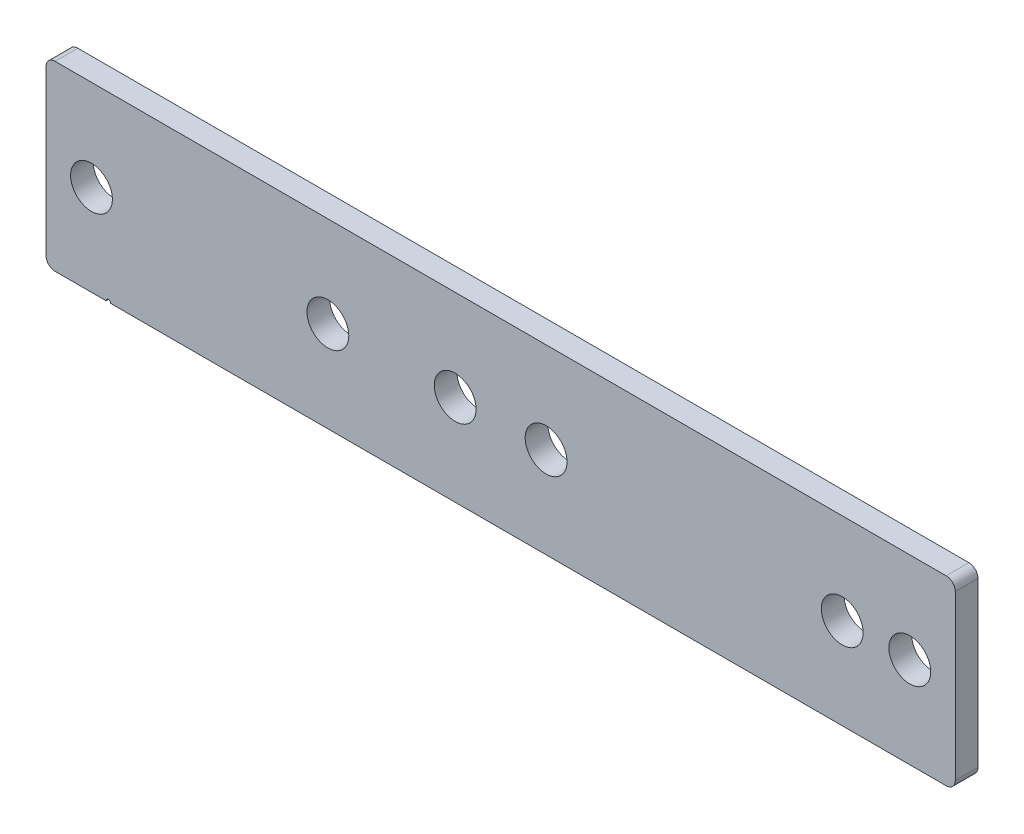
ISO-10303-21;
HEADER;
FILE_DESCRIPTION(('STEP AP214'),'2;1');
FILE_NAME('part.step','',(''),(''),'','','');
FILE_SCHEMA(('AUTOMOTIVE_DESIGN { 1 0 10303 214 1 1 1 1 }'));
ENDSEC;
DATA;
#1=APPLICATION_CONTEXT('core data for automotive mechanical design processes');
#2=APPLICATION_PROTOCOL_DEFINITION('international standard','automotive_design',2000,#1);
#3=PRODUCT_CONTEXT('',#1,'mechanical');
#4=PRODUCT('Part','Part','',(#3));
#5=PRODUCT_RELATED_PRODUCT_CATEGORY('part','',(#4));
#6=PRODUCT_DEFINITION_FORMATION('','',#4);
#7=PRODUCT_DEFINITION_CONTEXT('part definition',#1,'design');
#8=PRODUCT_DEFINITION('design','',#6,#7);
#9=PRODUCT_DEFINITION_SHAPE('','',#8);
#10=(LENGTH_UNIT() NAMED_UNIT(*) SI_UNIT(.MILLI.,.METRE.));
#11=(NAMED_UNIT(*) PLANE_ANGLE_UNIT() SI_UNIT($,.RADIAN.));
#12=(NAMED_UNIT(*) SI_UNIT($,.STERADIAN.) SOLID_ANGLE_UNIT());
#13=UNCERTAINTY_MEASURE_WITH_UNIT(LENGTH_MEASURE(1.E-05),#10,'distance_accuracy_value','');
#14=(GEOMETRIC_REPRESENTATION_CONTEXT(3) GLOBAL_UNCERTAINTY_ASSIGNED_CONTEXT((#13)) GLOBAL_UNIT_ASSIGNED_CONTEXT((#10,
#11,#12)) REPRESENTATION_CONTEXT('',''));
#15=CARTESIAN_POINT('',(0.,0.,0.));
#16=DIRECTION('',(0.,0.,1.));
#17=DIRECTION('',(1.,0.,0.));
#18=AXIS2_PLACEMENT_3D('',#15,#16,#17);
#19=CARTESIAN_POINT('',(-100.,-20.,5.));
#20=DIRECTION('',(0.,1.,0.));
#21=DIRECTION('',(-1.,0.,0.));
#22=AXIS2_PLACEMENT_3D('',#19,#20,#21);
#23=PLANE('',#22);
#24=DIRECTION('',(1.,0.,0.));
#25=VECTOR('',#24,1.);
#26=CARTESIAN_POINT('',(-100.,-20.,5.));
#27=LINE('',#26,#25);
#28=CARTESIAN_POINT('',(-98.,-20.,5.));
#29=VERTEX_POINT('',#28);
#30=CARTESIAN_POINT('',(-86.7842712474616,-20.,5.));
#31=VERTEX_POINT('',#30);
#32=EDGE_CURVE('E95',#29,#31,#27,.T.);
#33=ORIENTED_EDGE('',*,*,#32,.F.);
#34=DIRECTION('',(0.,0.,-1.));
#35=VECTOR('',#34,1.);
#36=CARTESIAN_POINT('',(-98.,-20.,5.));
#37=LINE('',#36,#35);
#38=CARTESIAN_POINT('',(-98.,-20.,0.));
#39=VERTEX_POINT('',#38);
#40=EDGE_CURVE('E10',#29,#39,#37,.T.);
#41=ORIENTED_EDGE('',*,*,#40,.T.);
#42=DIRECTION('',(1.,0.,0.));
#43=VECTOR('',#42,1.);
#44=CARTESIAN_POINT('',(-100.,-20.,0.));
#45=LINE('',#44,#43);
#46=CARTESIAN_POINT('',(-86.7842712474616,-20.,0.));
#47=VERTEX_POINT('',#46);
#48=EDGE_CURVE('E119',#39,#47,#45,.T.);
#49=ORIENTED_EDGE('',*,*,#48,.T.);
#50=DIRECTION('',(0.,0.,1.));
#51=VECTOR('',#50,1.);
#52=CARTESIAN_POINT('',(-86.7842712474616,-20.,-13.0107647738325));
#53=LINE('',#52,#51);
#54=EDGE_CURVE('E112',#47,#31,#53,.T.);
#55=ORIENTED_EDGE('',*,*,#54,.T.);
#56=EDGE_LOOP('',(#33,#41,#49,#55));
#57=FACE_BOUND('',#56,.T.);
#58=ADVANCED_FACE('F16',(#57),#23,.F.);
#59=CARTESIAN_POINT('',(-100.,20.,5.));
#60=DIRECTION('',(1.,0.,0.));
#61=DIRECTION('',(0.,1.,0.));
#62=AXIS2_PLACEMENT_3D('',#59,#60,#61);
#63=PLANE('',#62);
#64=DIRECTION('',(0.,-1.,0.));
#65=VECTOR('',#64,1.);
#66=CARTESIAN_POINT('',(-100.,20.,5.));
#67=LINE('',#66,#65);
#68=CARTESIAN_POINT('',(-100.,18.,5.));
#69=VERTEX_POINT('',#68);
#70=CARTESIAN_POINT('',(-100.,-18.,5.));
#71=VERTEX_POINT('',#70);
#72=EDGE_CURVE('E132',#69,#71,#67,.T.);
#73=ORIENTED_EDGE('',*,*,#72,.F.);
#74=DIRECTION('',(0.,0.,-1.));
#75=VECTOR('',#74,1.);
#76=CARTESIAN_POINT('',(-100.,18.,5.));
#77=LINE('',#76,#75);
#78=CARTESIAN_POINT('',(-100.,18.,0.));
#79=VERTEX_POINT('',#78);
#80=EDGE_CURVE('E25',#69,#79,#77,.T.);
#81=ORIENTED_EDGE('',*,*,#80,.T.);
#82=DIRECTION('',(0.,-1.,0.));
#83=VECTOR('',#82,1.);
#84=CARTESIAN_POINT('',(-100.,20.,0.));
#85=LINE('',#84,#83);
#86=CARTESIAN_POINT('',(-100.,-18.,0.));
#87=VERTEX_POINT('',#86);
#88=EDGE_CURVE('E131',#79,#87,#85,.T.);
#89=ORIENTED_EDGE('',*,*,#88,.T.);
#90=DIRECTION('',(0.,0.,-1.));
#91=VECTOR('',#90,1.);
#92=CARTESIAN_POINT('',(-100.,-18.,5.));
#93=LINE('',#92,#91);
#94=EDGE_CURVE('E41',#87,#71,#93,.F.);
#95=ORIENTED_EDGE('',*,*,#94,.T.);
#96=EDGE_LOOP('',(#73,#81,#89,#95));
#97=FACE_BOUND('',#96,.T.);
#98=ADVANCED_FACE('F233',(#97),#63,.F.);
#99=CARTESIAN_POINT('',(-85.7842712474616,-20.,0.));
#100=VERTEX_POINT('',#99);
#101=CARTESIAN_POINT('',(98.,-19.9999999999999,0.));
#102=VERTEX_POINT('',#101);
#103=EDGE_CURVE('E141',#100,#102,#45,.T.);
#104=ORIENTED_EDGE('',*,*,#103,.T.);
#105=DIRECTION('',(0.,0.,-1.));
#106=VECTOR('',#105,1.);
#107=CARTESIAN_POINT('',(98.,-19.9999999999999,5.));
#108=LINE('',#107,#106);
#109=CARTESIAN_POINT('',(98.,-19.9999999999999,5.));
#110=VERTEX_POINT('',#109);
#111=EDGE_CURVE('E172',#102,#110,#108,.F.);
#112=ORIENTED_EDGE('',*,*,#111,.T.);
#113=CARTESIAN_POINT('',(-85.7842712474616,-20.,5.));
#114=VERTEX_POINT('',#113);
#115=EDGE_CURVE('E107',#114,#110,#27,.T.);
#116=ORIENTED_EDGE('',*,*,#115,.F.);
#117=DIRECTION('',(0.,0.,1.));
#118=VECTOR('',#117,1.);
#119=CARTESIAN_POINT('',(-85.7842712474616,-20.,-13.0107647738325));
#120=LINE('',#119,#118);
#121=EDGE_CURVE('E115',#100,#114,#120,.T.);
#122=ORIENTED_EDGE('',*,*,#121,.F.);
#123=EDGE_LOOP('',(#104,#112,#116,#122));
#124=FACE_BOUND('',#123,.T.);
#125=ADVANCED_FACE('F207',(#124),#23,.F.);
#126=CARTESIAN_POINT('',(100.,20.,5.));
#127=DIRECTION('',(-1.,0.,0.));
#128=DIRECTION('',(0.,0.,1.));
#129=AXIS2_PLACEMENT_3D('',#126,#127,#128);
#130=PLANE('',#129);
#131=DIRECTION('',(0.,1.,0.));
#132=VECTOR('',#131,1.);
#133=CARTESIAN_POINT('',(100.,20.,0.));
#134=LINE('',#133,#132);
#135=CARTESIAN_POINT('',(100.,-18.,0.));
#136=VERTEX_POINT('',#135);
#137=CARTESIAN_POINT('',(100.,18.,0.));
#138=VERTEX_POINT('',#137);
#139=EDGE_CURVE('E143',#136,#138,#134,.T.);
#140=ORIENTED_EDGE('',*,*,#139,.T.);
#141=DIRECTION('',(0.,0.,-1.));
#142=VECTOR('',#141,1.);
#143=CARTESIAN_POINT('',(100.,18.,5.));
#144=LINE('',#143,#142);
#145=CARTESIAN_POINT('',(100.,18.,5.));
#146=VERTEX_POINT('',#145);
#147=EDGE_CURVE('E163',#138,#146,#144,.F.);
#148=ORIENTED_EDGE('',*,*,#147,.T.);
#149=DIRECTION('',(0.,1.,0.));
#150=VECTOR('',#149,1.);
#151=CARTESIAN_POINT('',(100.,20.,5.));
#152=LINE('',#151,#150);
#153=CARTESIAN_POINT('',(100.,-18.,5.));
#154=VERTEX_POINT('',#153);
#155=EDGE_CURVE('E106',#154,#146,#152,.T.);
#156=ORIENTED_EDGE('',*,*,#155,.F.);
#157=DIRECTION('',(0.,0.,-1.));
#158=VECTOR('',#157,1.);
#159=CARTESIAN_POINT('',(100.,-18.,5.));
#160=LINE('',#159,#158);
#161=EDGE_CURVE('E160',#154,#136,#160,.T.);
#162=ORIENTED_EDGE('',*,*,#161,.T.);
#163=EDGE_LOOP('',(#140,#148,#156,#162));
#164=FACE_BOUND('',#163,.T.);
#165=ADVANCED_FACE('F218',(#164),#130,.F.);
#166=CARTESIAN_POINT('',(-100.,20.,5.));
#167=DIRECTION('',(0.,-1.,0.));
#168=DIRECTION('',(1.,0.,0.));
#169=AXIS2_PLACEMENT_3D('',#166,#167,#168);
#170=PLANE('',#169);
#171=DIRECTION('',(-1.,0.,0.));
#172=VECTOR('',#171,1.);
#173=CARTESIAN_POINT('',(-100.,20.,5.));
#174=LINE('',#173,#172);
#175=CARTESIAN_POINT('',(98.,20.,5.));
#176=VERTEX_POINT('',#175);
#177=CARTESIAN_POINT('',(-98.,20.,5.));
#178=VERTEX_POINT('',#177);
#179=EDGE_CURVE('E136',#176,#178,#174,.T.);
#180=ORIENTED_EDGE('',*,*,#179,.F.);
#181=DIRECTION('',(0.,0.,-1.));
#182=VECTOR('',#181,1.);
#183=CARTESIAN_POINT('',(98.,20.,5.));
#184=LINE('',#183,#182);
#185=CARTESIAN_POINT('',(98.,20.,0.));
#186=VERTEX_POINT('',#185);
#187=EDGE_CURVE('E149',#176,#186,#184,.T.);
#188=ORIENTED_EDGE('',*,*,#187,.T.);
#189=DIRECTION('',(-1.,0.,0.));
#190=VECTOR('',#189,1.);
#191=CARTESIAN_POINT('',(-100.,20.,0.));
#192=LINE('',#191,#190);
#193=CARTESIAN_POINT('',(-98.,20.,0.));
#194=VERTEX_POINT('',#193);
#195=EDGE_CURVE('E133',#186,#194,#192,.T.);
#196=ORIENTED_EDGE('',*,*,#195,.T.);
#197=DIRECTION('',(0.,0.,-1.));
#198=VECTOR('',#197,1.);
#199=CARTESIAN_POINT('',(-98.,20.,5.));
#200=LINE('',#199,#198);
#201=EDGE_CURVE('E139',#194,#178,#200,.F.);
#202=ORIENTED_EDGE('',*,*,#201,.T.);
#203=EDGE_LOOP('',(#180,#188,#196,#202));
#204=FACE_BOUND('',#203,.T.);
#205=ADVANCED_FACE('F226',(#204),#170,.F.);
#206=CARTESIAN_POINT('',(0.,0.,5.));
#207=DIRECTION('',(0.,0.,1.));
#208=DIRECTION('',(1.,0.,0.));
#209=AXIS2_PLACEMENT_3D('',#206,#207,#208);
#210=PLANE('',#209);
#211=CARTESIAN_POINT('',(-9.99999999999999,0.,5.));
#212=DIRECTION('',(0.,0.,1.));
#213=DIRECTION('',(1.,0.,0.));
#214=AXIS2_PLACEMENT_3D('',#211,#212,#213);
#215=CIRCLE('',#214,4.6);
#216=CARTESIAN_POINT('',(-5.4,0.,5.));
#217=VERTEX_POINT('',#216);
#218=EDGE_CURVE('E183',#217,#217,#215,.T.);
#219=ORIENTED_EDGE('',*,*,#218,.F.);
#220=EDGE_LOOP('',(#219));
#221=FACE_BOUND('',#220,.T.);
#222=CARTESIAN_POINT('',(10.,0.,5.));
#223=DIRECTION('',(0.,0.,1.));
#224=DIRECTION('',(1.,0.,0.));
#225=AXIS2_PLACEMENT_3D('',#222,#223,#224);
#226=CIRCLE('',#225,4.6);
#227=CARTESIAN_POINT('',(14.6,0.,5.));
#228=VERTEX_POINT('',#227);
#229=EDGE_CURVE('E290',#228,#228,#226,.T.);
#230=ORIENTED_EDGE('',*,*,#229,.F.);
#231=EDGE_LOOP('',(#230));
#232=FACE_BOUND('',#231,.T.);
#233=CARTESIAN_POINT('',(90.,0.,5.));
#234=DIRECTION('',(0.,0.,1.));
#235=DIRECTION('',(1.,0.,0.));
#236=AXIS2_PLACEMENT_3D('',#233,#234,#235);
#237=CIRCLE('',#236,4.60000000000001);
#238=CARTESIAN_POINT('',(94.6,0.,5.));
#239=VERTEX_POINT('',#238);
#240=EDGE_CURVE('E196',#239,#239,#237,.T.);
#241=ORIENTED_EDGE('',*,*,#240,.F.);
#242=EDGE_LOOP('',(#241));
#243=FACE_BOUND('',#242,.T.);
#244=CARTESIAN_POINT('',(-90.,0.,5.));
#245=DIRECTION('',(0.,0.,1.));
#246=DIRECTION('',(1.,0.,0.));
#247=AXIS2_PLACEMENT_3D('',#244,#245,#246);
#248=CIRCLE('',#247,4.6);
#249=CARTESIAN_POINT('',(-85.4,0.,5.));
#250=VERTEX_POINT('',#249);
#251=EDGE_CURVE('E179',#250,#250,#248,.T.);
#252=ORIENTED_EDGE('',*,*,#251,.F.);
#253=EDGE_LOOP('',(#252));
#254=FACE_BOUND('',#253,.T.);
#255=CARTESIAN_POINT('',(75.1370849898473,0.,5.));
#256=DIRECTION('',(0.,0.,1.));
#257=DIRECTION('',(1.,0.,0.));
#258=AXIS2_PLACEMENT_3D('',#255,#256,#257);
#259=CIRCLE('',#258,4.60000000000001);
#260=CARTESIAN_POINT('',(79.7370849898473,0.,5.));
#261=VERTEX_POINT('',#260);
#262=EDGE_CURVE('E198',#261,#261,#259,.T.);
#263=ORIENTED_EDGE('',*,*,#262,.F.);
#264=EDGE_LOOP('',(#263));
#265=FACE_BOUND('',#264,.T.);
#266=ORIENTED_EDGE('',*,*,#155,.T.);
#267=CARTESIAN_POINT('',(98.,18.,5.));
#268=DIRECTION('',(0.,0.,1.));
#269=DIRECTION('',(1.,0.,0.));
#270=AXIS2_PLACEMENT_3D('',#267,#268,#269);
#271=CIRCLE('',#270,2.);
#272=EDGE_CURVE('E170',#146,#176,#271,.T.);
#273=ORIENTED_EDGE('',*,*,#272,.T.);
#274=ORIENTED_EDGE('',*,*,#179,.T.);
#275=CARTESIAN_POINT('',(-98.,18.,5.));
#276=DIRECTION('',(0.,0.,1.));
#277=DIRECTION('',(1.,0.,0.));
#278=AXIS2_PLACEMENT_3D('',#275,#276,#277);
#279=CIRCLE('',#278,2.);
#280=EDGE_CURVE('E166',#178,#69,#279,.T.);
#281=ORIENTED_EDGE('',*,*,#280,.T.);
#282=ORIENTED_EDGE('',*,*,#72,.T.);
#283=CARTESIAN_POINT('',(-98.,-18.,5.));
#284=DIRECTION('',(0.,0.,1.));
#285=DIRECTION('',(1.,0.,0.));
#286=AXIS2_PLACEMENT_3D('',#283,#284,#285);
#287=CIRCLE('',#286,2.);
#288=EDGE_CURVE('E33',#71,#29,#287,.T.);
#289=ORIENTED_EDGE('',*,*,#288,.T.);
#290=ORIENTED_EDGE('',*,*,#32,.T.);
#291=CARTESIAN_POINT('',(-86.2842712474618,-20.,5.));
#292=DIRECTION('',(0.,0.,1.));
#293=DIRECTION('',(1.,0.,0.));
#294=AXIS2_PLACEMENT_3D('',#291,#292,#293);
#295=CIRCLE('',#294,0.5);
#296=EDGE_CURVE('E101',#114,#31,#295,.T.);
#297=ORIENTED_EDGE('',*,*,#296,.F.);
#298=ORIENTED_EDGE('',*,*,#115,.T.);
#299=CARTESIAN_POINT('',(98.,-18.,5.));
#300=DIRECTION('',(0.,0.,1.));
#301=DIRECTION('',(1.,0.,0.));
#302=AXIS2_PLACEMENT_3D('',#299,#300,#301);
#303=CIRCLE('',#302,2.);
#304=EDGE_CURVE('E168',#110,#154,#303,.T.);
#305=ORIENTED_EDGE('',*,*,#304,.T.);
#306=EDGE_LOOP('',(#266,#273,#274,#281,#282,#289,#290,#297,#298,#305));
#307=FACE_BOUND('',#306,.T.);
#308=CARTESIAN_POINT('',(-38.,0.,5.));
#309=DIRECTION('',(0.,0.,1.));
#310=DIRECTION('',(1.,0.,0.));
#311=AXIS2_PLACEMENT_3D('',#308,#309,#310);
#312=CIRCLE('',#311,4.6);
#313=CARTESIAN_POINT('',(-33.4,0.,5.));
#314=VERTEX_POINT('',#313);
#315=EDGE_CURVE('E124',#314,#314,#312,.T.);
#316=ORIENTED_EDGE('',*,*,#315,.F.);
#317=EDGE_LOOP('',(#316));
#318=FACE_BOUND('',#317,.T.);
#319=ADVANCED_FACE('F98',(#221,#232,#243,#254,#265,#307,#318),#210,.T.);
#320=CARTESIAN_POINT('',(0.,0.,0.));
#321=DIRECTION('',(0.,0.,1.));
#322=DIRECTION('',(1.,0.,0.));
#323=AXIS2_PLACEMENT_3D('',#320,#321,#322);
#324=PLANE('',#323);
#325=CARTESIAN_POINT('',(-9.99999999999999,0.,0.));
#326=DIRECTION('',(0.,0.,1.));
#327=DIRECTION('',(1.,0.,0.));
#328=AXIS2_PLACEMENT_3D('',#325,#326,#327);
#329=CIRCLE('',#328,4.6);
#330=CARTESIAN_POINT('',(-5.4,0.,0.));
#331=VERTEX_POINT('',#330);
#332=EDGE_CURVE('E20',#331,#331,#329,.T.);
#333=ORIENTED_EDGE('',*,*,#332,.T.);
#334=EDGE_LOOP('',(#333));
#335=FACE_BOUND('',#334,.T.);
#336=CARTESIAN_POINT('',(10.,0.,0.));
#337=DIRECTION('',(0.,0.,1.));
#338=DIRECTION('',(1.,0.,0.));
#339=AXIS2_PLACEMENT_3D('',#336,#337,#338);
#340=CIRCLE('',#339,4.6);
#341=CARTESIAN_POINT('',(14.6,0.,0.));
#342=VERTEX_POINT('',#341);
#343=EDGE_CURVE('E182',#342,#342,#340,.T.);
#344=ORIENTED_EDGE('',*,*,#343,.T.);
#345=EDGE_LOOP('',(#344));
#346=FACE_BOUND('',#345,.T.);
#347=CARTESIAN_POINT('',(90.,0.,0.));
#348=DIRECTION('',(0.,0.,1.));
#349=DIRECTION('',(1.,0.,0.));
#350=AXIS2_PLACEMENT_3D('',#347,#348,#349);
#351=CIRCLE('',#350,4.60000000000001);
#352=CARTESIAN_POINT('',(94.6,0.,0.));
#353=VERTEX_POINT('',#352);
#354=EDGE_CURVE('E180',#353,#353,#351,.T.);
#355=ORIENTED_EDGE('',*,*,#354,.T.);
#356=EDGE_LOOP('',(#355));
#357=FACE_BOUND('',#356,.T.);
#358=CARTESIAN_POINT('',(-90.,0.,0.));
#359=DIRECTION('',(0.,0.,1.));
#360=DIRECTION('',(1.,0.,0.));
#361=AXIS2_PLACEMENT_3D('',#358,#359,#360);
#362=CIRCLE('',#361,4.6);
#363=CARTESIAN_POINT('',(-85.4,0.,0.));
#364=VERTEX_POINT('',#363);
#365=EDGE_CURVE('E116',#364,#364,#362,.T.);
#366=ORIENTED_EDGE('',*,*,#365,.T.);
#367=EDGE_LOOP('',(#366));
#368=FACE_BOUND('',#367,.T.);
#369=CARTESIAN_POINT('',(75.1370849898473,0.,0.));
#370=DIRECTION('',(0.,0.,1.));
#371=DIRECTION('',(1.,0.,0.));
#372=AXIS2_PLACEMENT_3D('',#369,#370,#371);
#373=CIRCLE('',#372,4.60000000000001);
#374=CARTESIAN_POINT('',(79.7370849898473,0.,0.));
#375=VERTEX_POINT('',#374);
#376=EDGE_CURVE('E128',#375,#375,#373,.F.);
#377=ORIENTED_EDGE('',*,*,#376,.F.);
#378=EDGE_LOOP('',(#377));
#379=FACE_BOUND('',#378,.T.);
#380=CARTESIAN_POINT('',(-38.,0.,0.));
#381=DIRECTION('',(0.,0.,1.));
#382=DIRECTION('',(1.,0.,0.));
#383=AXIS2_PLACEMENT_3D('',#380,#381,#382);
#384=CIRCLE('',#383,4.6);
#385=CARTESIAN_POINT('',(-33.4,0.,0.));
#386=VERTEX_POINT('',#385);
#387=EDGE_CURVE('E127',#386,#386,#384,.F.);
#388=ORIENTED_EDGE('',*,*,#387,.F.);
#389=EDGE_LOOP('',(#388));
#390=FACE_BOUND('',#389,.T.);
#391=ORIENTED_EDGE('',*,*,#195,.F.);
#392=CARTESIAN_POINT('',(98.,18.,0.));
#393=DIRECTION('',(0.,0.,1.));
#394=DIRECTION('',(1.,0.,0.));
#395=AXIS2_PLACEMENT_3D('',#392,#393,#394);
#396=CIRCLE('',#395,2.);
#397=EDGE_CURVE('E158',#186,#138,#396,.F.);
#398=ORIENTED_EDGE('',*,*,#397,.T.);
#399=ORIENTED_EDGE('',*,*,#139,.F.);
#400=CARTESIAN_POINT('',(98.,-18.,0.));
#401=DIRECTION('',(0.,0.,1.));
#402=DIRECTION('',(1.,0.,0.));
#403=AXIS2_PLACEMENT_3D('',#400,#401,#402);
#404=CIRCLE('',#403,2.);
#405=EDGE_CURVE('E156',#136,#102,#404,.F.);
#406=ORIENTED_EDGE('',*,*,#405,.T.);
#407=ORIENTED_EDGE('',*,*,#103,.F.);
#408=CARTESIAN_POINT('',(-86.2842712474618,-20.,0.));
#409=DIRECTION('',(0.,0.,1.));
#410=DIRECTION('',(1.,0.,0.));
#411=AXIS2_PLACEMENT_3D('',#408,#409,#410);
#412=CIRCLE('',#411,0.5);
#413=EDGE_CURVE('E121',#47,#100,#412,.F.);
#414=ORIENTED_EDGE('',*,*,#413,.F.);
#415=ORIENTED_EDGE('',*,*,#48,.F.);
#416=CARTESIAN_POINT('',(-98.,-18.,0.));
#417=DIRECTION('',(0.,0.,1.));
#418=DIRECTION('',(1.,0.,0.));
#419=AXIS2_PLACEMENT_3D('',#416,#417,#418);
#420=CIRCLE('',#419,2.);
#421=EDGE_CURVE('E152',#39,#87,#420,.F.);
#422=ORIENTED_EDGE('',*,*,#421,.T.);
#423=ORIENTED_EDGE('',*,*,#88,.F.);
#424=CARTESIAN_POINT('',(-98.,18.,0.));
#425=DIRECTION('',(0.,0.,1.));
#426=DIRECTION('',(1.,0.,0.));
#427=AXIS2_PLACEMENT_3D('',#424,#425,#426);
#428=CIRCLE('',#427,2.);
#429=EDGE_CURVE('E154',#79,#194,#428,.F.);
#430=ORIENTED_EDGE('',*,*,#429,.T.);
#431=EDGE_LOOP('',(#391,#398,#399,#406,#407,#414,#415,#422,#423,#430));
#432=FACE_BOUND('',#431,.T.);
#433=ADVANCED_FACE('F210',(#335,#346,#357,#368,#379,#390,#432),#324,.F.);
#434=CARTESIAN_POINT('',(-38.,0.,-13.0107647738325));
#435=DIRECTION('',(0.,0.,1.));
#436=DIRECTION('',(1.,0.,0.));
#437=AXIS2_PLACEMENT_3D('',#434,#435,#436);
#438=CYLINDRICAL_SURFACE('',#437,4.6);
#439=ORIENTED_EDGE('',*,*,#387,.T.);
#440=EDGE_LOOP('',(#439));
#441=FACE_BOUND('',#440,.T.);
#442=ORIENTED_EDGE('',*,*,#315,.T.);
#443=EDGE_LOOP('',(#442));
#444=FACE_BOUND('',#443,.T.);
#445=ADVANCED_FACE('F262',(#441,#444),#438,.F.);
#446=CARTESIAN_POINT('',(-86.2842712474618,-20.,-13.0107647738325));
#447=DIRECTION('',(0.,0.,1.));
#448=DIRECTION('',(1.,0.,0.));
#449=AXIS2_PLACEMENT_3D('',#446,#447,#448);
#450=CYLINDRICAL_SURFACE('',#449,0.5);
#451=ORIENTED_EDGE('',*,*,#413,.T.);
#452=ORIENTED_EDGE('',*,*,#121,.T.);
#453=ORIENTED_EDGE('',*,*,#296,.T.);
#454=ORIENTED_EDGE('',*,*,#54,.F.);
#455=EDGE_LOOP('',(#451,#452,#453,#454));
#456=FACE_BOUND('',#455,.T.);
#457=ADVANCED_FACE('F111',(#456),#450,.F.);
#458=CARTESIAN_POINT('',(75.1370849898473,0.,-13.0107647738325));
#459=DIRECTION('',(0.,0.,1.));
#460=DIRECTION('',(1.,0.,0.));
#461=AXIS2_PLACEMENT_3D('',#458,#459,#460);
#462=CYLINDRICAL_SURFACE('',#461,4.60000000000001);
#463=ORIENTED_EDGE('',*,*,#376,.T.);
#464=EDGE_LOOP('',(#463));
#465=FACE_BOUND('',#464,.T.);
#466=ORIENTED_EDGE('',*,*,#262,.T.);
#467=EDGE_LOOP('',(#466));
#468=FACE_BOUND('',#467,.T.);
#469=ADVANCED_FACE('F271',(#465,#468),#462,.F.);
#470=CARTESIAN_POINT('',(98.,18.,5.));
#471=DIRECTION('',(0.,0.,-1.));
#472=DIRECTION('',(-1.,0.,0.));
#473=AXIS2_PLACEMENT_3D('',#470,#471,#472);
#474=CYLINDRICAL_SURFACE('',#473,2.);
#475=ORIENTED_EDGE('',*,*,#272,.F.);
#476=ORIENTED_EDGE('',*,*,#147,.F.);
#477=ORIENTED_EDGE('',*,*,#397,.F.);
#478=ORIENTED_EDGE('',*,*,#187,.F.);
#479=EDGE_LOOP('',(#475,#476,#477,#478));
#480=FACE_BOUND('',#479,.T.);
#481=ADVANCED_FACE('F224',(#480),#474,.T.);
#482=CARTESIAN_POINT('',(98.,-18.,5.));
#483=DIRECTION('',(0.,0.,-1.));
#484=DIRECTION('',(-1.,0.,0.));
#485=AXIS2_PLACEMENT_3D('',#482,#483,#484);
#486=CYLINDRICAL_SURFACE('',#485,2.);
#487=ORIENTED_EDGE('',*,*,#304,.F.);
#488=ORIENTED_EDGE('',*,*,#111,.F.);
#489=ORIENTED_EDGE('',*,*,#405,.F.);
#490=ORIENTED_EDGE('',*,*,#161,.F.);
#491=EDGE_LOOP('',(#487,#488,#489,#490));
#492=FACE_BOUND('',#491,.T.);
#493=ADVANCED_FACE('F215',(#492),#486,.T.);
#494=CARTESIAN_POINT('',(-98.,18.,5.));
#495=DIRECTION('',(0.,0.,-1.));
#496=DIRECTION('',(-1.,0.,0.));
#497=AXIS2_PLACEMENT_3D('',#494,#495,#496);
#498=CYLINDRICAL_SURFACE('',#497,2.);
#499=ORIENTED_EDGE('',*,*,#280,.F.);
#500=ORIENTED_EDGE('',*,*,#201,.F.);
#501=ORIENTED_EDGE('',*,*,#429,.F.);
#502=ORIENTED_EDGE('',*,*,#80,.F.);
#503=EDGE_LOOP('',(#499,#500,#501,#502));
#504=FACE_BOUND('',#503,.T.);
#505=ADVANCED_FACE('F232',(#504),#498,.T.);
#506=CARTESIAN_POINT('',(-98.,-18.,5.));
#507=DIRECTION('',(0.,0.,-1.));
#508=DIRECTION('',(-1.,0.,0.));
#509=AXIS2_PLACEMENT_3D('',#506,#507,#508);
#510=CYLINDRICAL_SURFACE('',#509,2.);
#511=ORIENTED_EDGE('',*,*,#288,.F.);
#512=ORIENTED_EDGE('',*,*,#94,.F.);
#513=ORIENTED_EDGE('',*,*,#421,.F.);
#514=ORIENTED_EDGE('',*,*,#40,.F.);
#515=EDGE_LOOP('',(#511,#512,#513,#514));
#516=FACE_BOUND('',#515,.T.);
#517=ADVANCED_FACE('F18',(#516),#510,.T.);
#518=CARTESIAN_POINT('',(-90.,0.,-5.));
#519=DIRECTION('',(0.,0.,1.));
#520=DIRECTION('',(1.,0.,0.));
#521=AXIS2_PLACEMENT_3D('',#518,#519,#520);
#522=CYLINDRICAL_SURFACE('',#521,4.6);
#523=ORIENTED_EDGE('',*,*,#251,.T.);
#524=EDGE_LOOP('',(#523));
#525=FACE_BOUND('',#524,.T.);
#526=ORIENTED_EDGE('',*,*,#365,.F.);
#527=EDGE_LOOP('',(#526));
#528=FACE_BOUND('',#527,.T.);
#529=ADVANCED_FACE('F236',(#525,#528),#522,.F.);
#530=CARTESIAN_POINT('',(90.,0.,-5.));
#531=DIRECTION('',(0.,0.,1.));
#532=DIRECTION('',(1.,0.,0.));
#533=AXIS2_PLACEMENT_3D('',#530,#531,#532);
#534=CYLINDRICAL_SURFACE('',#533,4.60000000000001);
#535=ORIENTED_EDGE('',*,*,#240,.T.);
#536=EDGE_LOOP('',(#535));
#537=FACE_BOUND('',#536,.T.);
#538=ORIENTED_EDGE('',*,*,#354,.F.);
#539=EDGE_LOOP('',(#538));
#540=FACE_BOUND('',#539,.T.);
#541=ADVANCED_FACE('F242',(#537,#540),#534,.F.);
#542=CARTESIAN_POINT('',(10.,0.,-5.));
#543=DIRECTION('',(0.,0.,1.));
#544=DIRECTION('',(1.,0.,0.));
#545=AXIS2_PLACEMENT_3D('',#542,#543,#544);
#546=CYLINDRICAL_SURFACE('',#545,4.6);
#547=ORIENTED_EDGE('',*,*,#229,.T.);
#548=EDGE_LOOP('',(#547));
#549=FACE_BOUND('',#548,.T.);
#550=ORIENTED_EDGE('',*,*,#343,.F.);
#551=EDGE_LOOP('',(#550));
#552=FACE_BOUND('',#551,.T.);
#553=ADVANCED_FACE('F277',(#549,#552),#546,.F.);
#554=CARTESIAN_POINT('',(-9.99999999999999,0.,-5.));
#555=DIRECTION('',(0.,0.,1.));
#556=DIRECTION('',(1.,0.,0.));
#557=AXIS2_PLACEMENT_3D('',#554,#555,#556);
#558=CYLINDRICAL_SURFACE('',#557,4.6);
#559=ORIENTED_EDGE('',*,*,#218,.T.);
#560=EDGE_LOOP('',(#559));
#561=FACE_BOUND('',#560,.T.);
#562=ORIENTED_EDGE('',*,*,#332,.F.);
#563=EDGE_LOOP('',(#562));
#564=FACE_BOUND('',#563,.T.);
#565=ADVANCED_FACE('F281',(#561,#564),#558,.F.);
#566=CLOSED_SHELL('',(#58,#98,#125,#165,#205,#319,#433,#445,#457,#469,#481,#493,#505,#517,#529,
#541,#553,#565));
#567=MANIFOLD_SOLID_BREP('B1',#566);
#568=ADVANCED_BREP_SHAPE_REPRESENTATION('',(#18,#567),#14);
#569=SHAPE_DEFINITION_REPRESENTATION(#9,#568);
ENDSEC;
END-ISO-10303-21;
